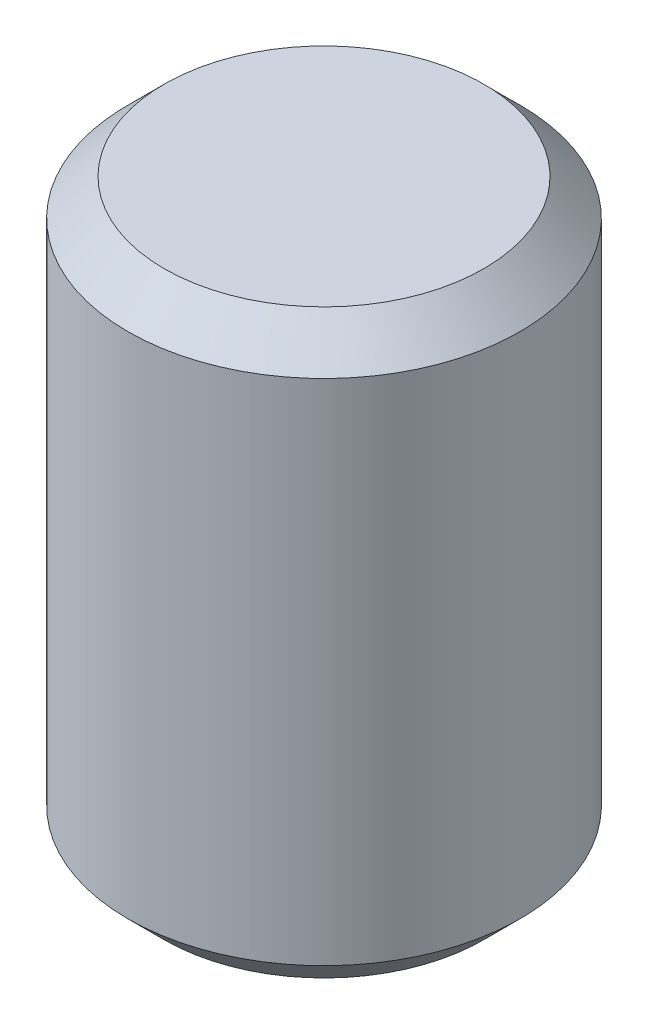
ISO-10303-21;
HEADER;
FILE_DESCRIPTION(('STEP AP214'),'2;1');
FILE_NAME('part.step','',(''),(''),'','','');
FILE_SCHEMA(('AUTOMOTIVE_DESIGN { 1 0 10303 214 1 1 1 1 }'));
ENDSEC;
DATA;
#1=APPLICATION_CONTEXT('core data for automotive mechanical design processes');
#2=APPLICATION_PROTOCOL_DEFINITION('international standard','automotive_design',2000,#1);
#3=PRODUCT_CONTEXT('',#1,'mechanical');
#4=PRODUCT('Part','Part','',(#3));
#5=PRODUCT_RELATED_PRODUCT_CATEGORY('part','',(#4));
#6=PRODUCT_DEFINITION_FORMATION('','',#4);
#7=PRODUCT_DEFINITION_CONTEXT('part definition',#1,'design');
#8=PRODUCT_DEFINITION('design','',#6,#7);
#9=PRODUCT_DEFINITION_SHAPE('','',#8);
#10=(LENGTH_UNIT() NAMED_UNIT(*) SI_UNIT(.MILLI.,.METRE.));
#11=(NAMED_UNIT(*) PLANE_ANGLE_UNIT() SI_UNIT($,.RADIAN.));
#12=(NAMED_UNIT(*) SI_UNIT($,.STERADIAN.) SOLID_ANGLE_UNIT());
#13=UNCERTAINTY_MEASURE_WITH_UNIT(LENGTH_MEASURE(1.E-05),#10,'distance_accuracy_value','');
#14=(GEOMETRIC_REPRESENTATION_CONTEXT(3) GLOBAL_UNCERTAINTY_ASSIGNED_CONTEXT((#13)) GLOBAL_UNIT_ASSIGNED_CONTEXT((#10,
#11,#12)) REPRESENTATION_CONTEXT('',''));
#15=CARTESIAN_POINT('',(0.,0.,0.));
#16=DIRECTION('',(0.,0.,1.));
#17=DIRECTION('',(1.,0.,0.));
#18=AXIS2_PLACEMENT_3D('',#15,#16,#17);
#19=CARTESIAN_POINT('',(0.,4.,0.));
#20=DIRECTION('',(0.,-1.,0.));
#21=DIRECTION('',(0.,0.,-1.));
#22=AXIS2_PLACEMENT_3D('',#19,#20,#21);
#23=CYLINDRICAL_SURFACE('',#22,1.35);
#24=CARTESIAN_POINT('',(0.,0.250000000000001,0.));
#25=DIRECTION('',(0.,1.,0.));
#26=DIRECTION('',(0.,0.,1.));
#27=AXIS2_PLACEMENT_3D('',#24,#25,#26);
#28=CIRCLE('',#27,1.35);
#29=CARTESIAN_POINT('',(0.,0.250000000000001,1.35));
#30=VERTEX_POINT('',#29);
#31=EDGE_CURVE('E47',#30,#30,#28,.T.);
#32=ORIENTED_EDGE('',*,*,#31,.T.);
#33=EDGE_LOOP('',(#32));
#34=FACE_BOUND('',#33,.T.);
#35=CARTESIAN_POINT('',(0.,3.75,0.));
#36=DIRECTION('',(0.,1.,0.));
#37=DIRECTION('',(0.,0.,1.));
#38=AXIS2_PLACEMENT_3D('',#35,#36,#37);
#39=CIRCLE('',#38,1.35);
#40=CARTESIAN_POINT('',(0.,3.75,1.35));
#41=VERTEX_POINT('',#40);
#42=EDGE_CURVE('E51',#41,#41,#39,.F.);
#43=ORIENTED_EDGE('',*,*,#42,.T.);
#44=EDGE_LOOP('',(#43));
#45=FACE_BOUND('',#44,.T.);
#46=ADVANCED_FACE('F35',(#34,#45),#23,.T.);
#47=CARTESIAN_POINT('',(0.,4.,0.));
#48=DIRECTION('',(0.,1.,0.));
#49=DIRECTION('',(0.,0.,1.));
#50=AXIS2_PLACEMENT_3D('',#47,#48,#49);
#51=PLANE('',#50);
#52=CARTESIAN_POINT('',(0.,4.,0.));
#53=DIRECTION('',(0.,1.,0.));
#54=DIRECTION('',(0.,0.,1.));
#55=AXIS2_PLACEMENT_3D('',#52,#53,#54);
#56=CIRCLE('',#55,1.1);
#57=CARTESIAN_POINT('',(0.,4.,1.1));
#58=VERTEX_POINT('',#57);
#59=EDGE_CURVE('E10',#58,#58,#56,.T.);
#60=ORIENTED_EDGE('',*,*,#59,.T.);
#61=EDGE_LOOP('',(#60));
#62=FACE_BOUND('',#61,.T.);
#63=ADVANCED_FACE('F67',(#62),#51,.T.);
#64=CARTESIAN_POINT('',(0.,0.,0.));
#65=DIRECTION('',(0.,1.,0.));
#66=DIRECTION('',(0.,0.,1.));
#67=AXIS2_PLACEMENT_3D('',#64,#65,#66);
#68=PLANE('',#67);
#69=CARTESIAN_POINT('',(0.,0.,0.));
#70=DIRECTION('',(0.,1.,0.));
#71=DIRECTION('',(0.,0.,1.));
#72=AXIS2_PLACEMENT_3D('',#69,#70,#71);
#73=CIRCLE('',#72,1.1);
#74=CARTESIAN_POINT('',(0.,0.,1.1));
#75=VERTEX_POINT('',#74);
#76=EDGE_CURVE('E43',#75,#75,#73,.F.);
#77=ORIENTED_EDGE('',*,*,#76,.T.);
#78=EDGE_LOOP('',(#77));
#79=FACE_BOUND('',#78,.T.);
#80=ADVANCED_FACE('F64',(#79),#68,.F.);
#81=CARTESIAN_POINT('',(0.,0.250000000000001,0.));
#82=DIRECTION('',(0.,1.,0.));
#83=DIRECTION('',(0.,0.,1.));
#84=AXIS2_PLACEMENT_3D('',#81,#82,#83);
#85=CONICAL_SURFACE('',#84,1.35,0.785398163397451);
#86=ORIENTED_EDGE('',*,*,#76,.F.);
#87=EDGE_LOOP('',(#86));
#88=FACE_BOUND('',#87,.T.);
#89=ORIENTED_EDGE('',*,*,#31,.F.);
#90=EDGE_LOOP('',(#89));
#91=FACE_BOUND('',#90,.T.);
#92=ADVANCED_FACE('F60',(#88,#91),#85,.T.);
#93=CARTESIAN_POINT('',(0.,4.,0.));
#94=DIRECTION('',(0.,-1.,0.));
#95=DIRECTION('',(0.,0.,-1.));
#96=AXIS2_PLACEMENT_3D('',#93,#94,#95);
#97=CONICAL_SURFACE('',#96,1.1,0.785398163397444);
#98=ORIENTED_EDGE('',*,*,#42,.F.);
#99=EDGE_LOOP('',(#98));
#100=FACE_BOUND('',#99,.T.);
#101=ORIENTED_EDGE('',*,*,#59,.F.);
#102=EDGE_LOOP('',(#101));
#103=FACE_BOUND('',#102,.T.);
#104=ADVANCED_FACE('F38',(#100,#103),#97,.T.);
#105=CLOSED_SHELL('',(#46,#63,#80,#92,#104));
#106=MANIFOLD_SOLID_BREP('B2',#105);
#107=ADVANCED_BREP_SHAPE_REPRESENTATION('',(#18,#106),#14);
#108=SHAPE_DEFINITION_REPRESENTATION(#9,#107);
ENDSEC;
END-ISO-10303-21;
